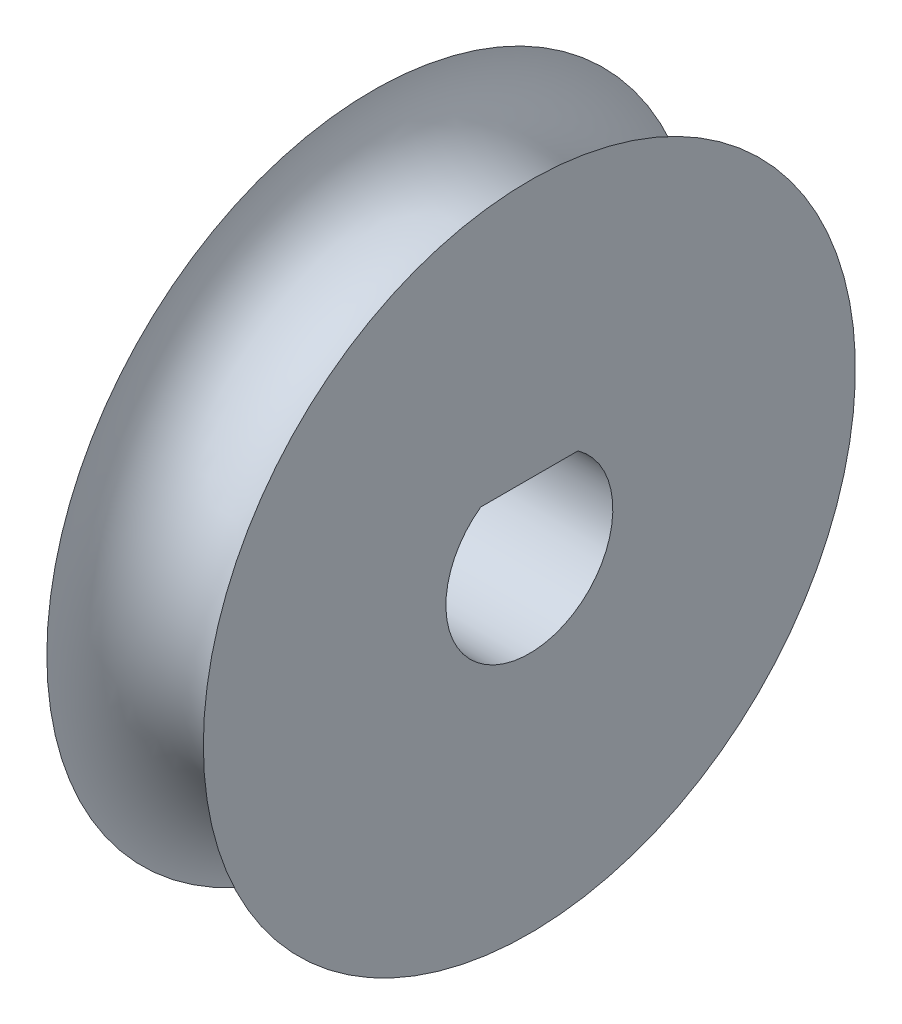
ISO-10303-21;
HEADER;
FILE_DESCRIPTION(('STEP AP214'),'2;1');
FILE_NAME('part.step','',(''),(''),'','','');
FILE_SCHEMA(('AUTOMOTIVE_DESIGN { 1 0 10303 214 1 1 1 1 }'));
ENDSEC;
DATA;
#1=APPLICATION_CONTEXT('core data for automotive mechanical design processes');
#2=APPLICATION_PROTOCOL_DEFINITION('international standard','automotive_design',2000,#1);
#3=PRODUCT_CONTEXT('',#1,'mechanical');
#4=PRODUCT('Part','Part','',(#3));
#5=PRODUCT_RELATED_PRODUCT_CATEGORY('part','',(#4));
#6=PRODUCT_DEFINITION_FORMATION('','',#4);
#7=PRODUCT_DEFINITION_CONTEXT('part definition',#1,'design');
#8=PRODUCT_DEFINITION('design','',#6,#7);
#9=PRODUCT_DEFINITION_SHAPE('','',#8);
#10=(LENGTH_UNIT() NAMED_UNIT(*) SI_UNIT(.MILLI.,.METRE.));
#11=(NAMED_UNIT(*) PLANE_ANGLE_UNIT() SI_UNIT($,.RADIAN.));
#12=(NAMED_UNIT(*) SI_UNIT($,.STERADIAN.) SOLID_ANGLE_UNIT());
#13=UNCERTAINTY_MEASURE_WITH_UNIT(LENGTH_MEASURE(1.E-05),#10,'distance_accuracy_value','');
#14=(GEOMETRIC_REPRESENTATION_CONTEXT(3) GLOBAL_UNCERTAINTY_ASSIGNED_CONTEXT((#13)) GLOBAL_UNIT_ASSIGNED_CONTEXT((#10,
#11,#12)) REPRESENTATION_CONTEXT('',''));
#15=CARTESIAN_POINT('',(0.,0.,0.));
#16=DIRECTION('',(0.,0.,1.));
#17=DIRECTION('',(1.,0.,0.));
#18=AXIS2_PLACEMENT_3D('',#15,#16,#17);
#19=CARTESIAN_POINT('',(0.,0.,0.));
#20=DIRECTION('',(-1.,0.,0.));
#21=DIRECTION('',(0.,0.,1.));
#22=AXIS2_PLACEMENT_3D('',#19,#20,#21);
#23=TOROIDAL_SURFACE('',#22,15.875,3.81);
#24=CARTESIAN_POINT('',(3.80999999999999,0.,0.));
#25=DIRECTION('',(-1.,0.,0.));
#26=DIRECTION('',(0.,0.,1.));
#27=AXIS2_PLACEMENT_3D('',#24,#25,#26);
#28=CIRCLE('',#27,15.875);
#29=CARTESIAN_POINT('',(3.80999999999999,0.,15.875));
#30=VERTEX_POINT('',#29);
#31=EDGE_CURVE('E40',#30,#30,#28,.T.);
#32=ORIENTED_EDGE('',*,*,#31,.T.);
#33=EDGE_LOOP('',(#32));
#34=FACE_BOUND('',#33,.T.);
#35=CARTESIAN_POINT('',(-3.81,0.,0.));
#36=DIRECTION('',(-1.,0.,0.));
#37=DIRECTION('',(0.,0.,1.));
#38=AXIS2_PLACEMENT_3D('',#35,#36,#37);
#39=CIRCLE('',#38,15.875);
#40=CARTESIAN_POINT('',(-3.81,0.,15.875));
#41=VERTEX_POINT('',#40);
#42=EDGE_CURVE('E11',#41,#41,#39,.T.);
#43=ORIENTED_EDGE('',*,*,#42,.F.);
#44=EDGE_LOOP('',(#43));
#45=FACE_BOUND('',#44,.T.);
#46=ADVANCED_FACE('F33',(#34,#45),#23,.F.);
#47=CARTESIAN_POINT('',(-3.81,15.875,0.));
#48=DIRECTION('',(1.,0.,0.));
#49=DIRECTION('',(0.,0.,-1.));
#50=AXIS2_PLACEMENT_3D('',#47,#48,#49);
#51=PLANE('',#50);
#52=DIRECTION('',(0.,0.,1.));
#53=VECTOR('',#52,1.);
#54=CARTESIAN_POINT('',(-3.81,3.302,2.36915427948456));
#55=LINE('',#54,#53);
#56=CARTESIAN_POINT('',(-3.81,3.302,-2.36915427948456));
#57=VERTEX_POINT('',#56);
#58=CARTESIAN_POINT('',(-3.81,3.302,2.36915427948456));
#59=VERTEX_POINT('',#58);
#60=EDGE_CURVE('E74',#57,#59,#55,.T.);
#61=ORIENTED_EDGE('',*,*,#60,.T.);
#62=CARTESIAN_POINT('',(-3.81,0.,0.));
#63=DIRECTION('',(1.,0.,0.));
#64=DIRECTION('',(0.,0.,-1.));
#65=AXIS2_PLACEMENT_3D('',#62,#63,#64);
#66=CIRCLE('',#65,4.064);
#67=EDGE_CURVE('E47',#59,#57,#66,.T.);
#68=ORIENTED_EDGE('',*,*,#67,.T.);
#69=EDGE_LOOP('',(#61,#68));
#70=FACE_BOUND('',#69,.T.);
#71=ORIENTED_EDGE('',*,*,#42,.T.);
#72=EDGE_LOOP('',(#71));
#73=FACE_BOUND('',#72,.T.);
#74=ADVANCED_FACE('F82',(#70,#73),#51,.F.);
#75=CARTESIAN_POINT('',(3.81,15.875,0.));
#76=DIRECTION('',(1.,0.,0.));
#77=DIRECTION('',(0.,0.,-1.));
#78=AXIS2_PLACEMENT_3D('',#75,#76,#77);
#79=PLANE('',#78);
#80=CARTESIAN_POINT('',(3.81,0.,0.));
#81=DIRECTION('',(1.,0.,0.));
#82=DIRECTION('',(0.,0.,-1.));
#83=AXIS2_PLACEMENT_3D('',#80,#81,#82);
#84=CIRCLE('',#83,4.064);
#85=CARTESIAN_POINT('',(3.81,3.302,2.36915427948456));
#86=VERTEX_POINT('',#85);
#87=CARTESIAN_POINT('',(3.81,3.302,-2.36915427948456));
#88=VERTEX_POINT('',#87);
#89=EDGE_CURVE('E52',#86,#88,#84,.T.);
#90=ORIENTED_EDGE('',*,*,#89,.F.);
#91=DIRECTION('',(0.,0.,1.));
#92=VECTOR('',#91,1.);
#93=CARTESIAN_POINT('',(3.81,3.302,2.36915427948456));
#94=LINE('',#93,#92);
#95=EDGE_CURVE('E66',#88,#86,#94,.T.);
#96=ORIENTED_EDGE('',*,*,#95,.F.);
#97=EDGE_LOOP('',(#90,#96));
#98=FACE_BOUND('',#97,.T.);
#99=ORIENTED_EDGE('',*,*,#31,.F.);
#100=EDGE_LOOP('',(#99));
#101=FACE_BOUND('',#100,.T.);
#102=ADVANCED_FACE('F70',(#98,#101),#79,.T.);
#103=CARTESIAN_POINT('',(-3.81,0.,0.));
#104=DIRECTION('',(1.,0.,0.));
#105=DIRECTION('',(0.,0.,-1.));
#106=AXIS2_PLACEMENT_3D('',#103,#104,#105);
#107=CYLINDRICAL_SURFACE('',#106,4.064);
#108=ORIENTED_EDGE('',*,*,#89,.T.);
#109=DIRECTION('',(1.,0.,0.));
#110=VECTOR('',#109,1.);
#111=CARTESIAN_POINT('',(-3.81,3.302,-2.36915427948456));
#112=LINE('',#111,#110);
#113=EDGE_CURVE('E63',#57,#88,#112,.T.);
#114=ORIENTED_EDGE('',*,*,#113,.F.);
#115=ORIENTED_EDGE('',*,*,#67,.F.);
#116=DIRECTION('',(1.,0.,0.));
#117=VECTOR('',#116,1.);
#118=CARTESIAN_POINT('',(-3.81,3.302,2.36915427948456));
#119=LINE('',#118,#117);
#120=EDGE_CURVE('E57',#59,#86,#119,.T.);
#121=ORIENTED_EDGE('',*,*,#120,.T.);
#122=EDGE_LOOP('',(#108,#114,#115,#121));
#123=FACE_BOUND('',#122,.T.);
#124=ADVANCED_FACE('F59',(#123),#107,.F.);
#125=CARTESIAN_POINT('',(-3.81,3.302,2.36915427948456));
#126=DIRECTION('',(0.,1.,0.));
#127=DIRECTION('',(0.,0.,1.));
#128=AXIS2_PLACEMENT_3D('',#125,#126,#127);
#129=PLANE('',#128);
#130=ORIENTED_EDGE('',*,*,#95,.T.);
#131=ORIENTED_EDGE('',*,*,#120,.F.);
#132=ORIENTED_EDGE('',*,*,#60,.F.);
#133=ORIENTED_EDGE('',*,*,#113,.T.);
#134=EDGE_LOOP('',(#130,#131,#132,#133));
#135=FACE_BOUND('',#134,.T.);
#136=ADVANCED_FACE('F67',(#135),#129,.F.);
#137=CLOSED_SHELL('',(#46,#74,#102,#124,#136));
#138=MANIFOLD_SOLID_BREP('B2',#137);
#139=ADVANCED_BREP_SHAPE_REPRESENTATION('',(#18,#138),#14);
#140=SHAPE_DEFINITION_REPRESENTATION(#9,#139);
ENDSEC;
END-ISO-10303-21;
